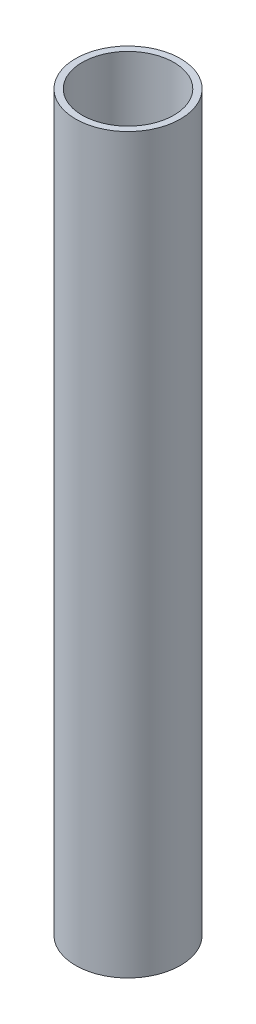
ISO-10303-21;
HEADER;
FILE_DESCRIPTION(('STEP AP214'),'2;1');
FILE_NAME('part.step','',(''),(''),'','','');
FILE_SCHEMA(('AUTOMOTIVE_DESIGN { 1 0 10303 214 1 1 1 1 }'));
ENDSEC;
DATA;
#1=APPLICATION_CONTEXT('core data for automotive mechanical design processes');
#2=APPLICATION_PROTOCOL_DEFINITION('international standard','automotive_design',2000,#1);
#3=PRODUCT_CONTEXT('',#1,'mechanical');
#4=PRODUCT('Part','Part','',(#3));
#5=PRODUCT_RELATED_PRODUCT_CATEGORY('part','',(#4));
#6=PRODUCT_DEFINITION_FORMATION('','',#4);
#7=PRODUCT_DEFINITION_CONTEXT('part definition',#1,'design');
#8=PRODUCT_DEFINITION('design','',#6,#7);
#9=PRODUCT_DEFINITION_SHAPE('','',#8);
#10=(LENGTH_UNIT() NAMED_UNIT(*) SI_UNIT(.MILLI.,.METRE.));
#11=(NAMED_UNIT(*) PLANE_ANGLE_UNIT() SI_UNIT($,.RADIAN.));
#12=(NAMED_UNIT(*) SI_UNIT($,.STERADIAN.) SOLID_ANGLE_UNIT());
#13=UNCERTAINTY_MEASURE_WITH_UNIT(LENGTH_MEASURE(1.E-05),#10,'distance_accuracy_value','');
#14=(GEOMETRIC_REPRESENTATION_CONTEXT(3) GLOBAL_UNCERTAINTY_ASSIGNED_CONTEXT((#13)) GLOBAL_UNIT_ASSIGNED_CONTEXT((#10,
#11,#12)) REPRESENTATION_CONTEXT('',''));
#15=CARTESIAN_POINT('',(0.,0.,0.));
#16=DIRECTION('',(0.,0.,1.));
#17=DIRECTION('',(1.,0.,0.));
#18=AXIS2_PLACEMENT_3D('',#15,#16,#17);
#19=CARTESIAN_POINT('',(0.,609.6,0.));
#20=DIRECTION('',(0.,1.,0.));
#21=DIRECTION('',(0.,0.,1.));
#22=AXIS2_PLACEMENT_3D('',#19,#20,#21);
#23=PLANE('',#22);
#24=CARTESIAN_POINT('',(0.,609.6,0.));
#25=DIRECTION('',(0.,1.,0.));
#26=DIRECTION('',(1.,0.,0.));
#27=AXIS2_PLACEMENT_3D('',#24,#25,#26);
#28=CIRCLE('',#27,43.5864);
#29=CARTESIAN_POINT('',(43.5864,609.6,0.));
#30=VERTEX_POINT('',#29);
#31=EDGE_CURVE('E11',#30,#30,#28,.T.);
#32=ORIENTED_EDGE('',*,*,#31,.T.);
#33=EDGE_LOOP('',(#32));
#34=FACE_BOUND('',#33,.T.);
#35=CARTESIAN_POINT('',(0.,609.6,0.));
#36=DIRECTION('',(0.,1.,0.));
#37=DIRECTION('',(0.,0.,1.));
#38=AXIS2_PLACEMENT_3D('',#35,#36,#37);
#39=CIRCLE('',#38,38.1);
#40=CARTESIAN_POINT('',(0.,609.6,38.1));
#41=VERTEX_POINT('',#40);
#42=EDGE_CURVE('E54',#41,#41,#39,.T.);
#43=ORIENTED_EDGE('',*,*,#42,.F.);
#44=EDGE_LOOP('',(#43));
#45=FACE_BOUND('',#44,.T.);
#46=ADVANCED_FACE('F43',(#34,#45),#23,.T.);
#47=CARTESIAN_POINT('',(0.,0.,0.));
#48=DIRECTION('',(0.,1.,0.));
#49=DIRECTION('',(0.,0.,1.));
#50=AXIS2_PLACEMENT_3D('',#47,#48,#49);
#51=PLANE('',#50);
#52=CARTESIAN_POINT('',(0.,0.,0.));
#53=DIRECTION('',(0.,1.,0.));
#54=DIRECTION('',(1.,0.,0.));
#55=AXIS2_PLACEMENT_3D('',#52,#53,#54);
#56=CIRCLE('',#55,43.5864);
#57=CARTESIAN_POINT('',(43.5864,0.,0.));
#58=VERTEX_POINT('',#57);
#59=EDGE_CURVE('E47',#58,#58,#56,.T.);
#60=ORIENTED_EDGE('',*,*,#59,.F.);
#61=EDGE_LOOP('',(#60));
#62=FACE_BOUND('',#61,.T.);
#63=CARTESIAN_POINT('',(0.,0.,0.));
#64=DIRECTION('',(0.,1.,0.));
#65=DIRECTION('',(0.,0.,1.));
#66=AXIS2_PLACEMENT_3D('',#63,#64,#65);
#67=CIRCLE('',#66,38.1);
#68=CARTESIAN_POINT('',(0.,0.,38.1));
#69=VERTEX_POINT('',#68);
#70=EDGE_CURVE('E56',#69,#69,#67,.T.);
#71=ORIENTED_EDGE('',*,*,#70,.T.);
#72=EDGE_LOOP('',(#71));
#73=FACE_BOUND('',#72,.T.);
#74=ADVANCED_FACE('F66',(#62,#73),#51,.F.);
#75=CARTESIAN_POINT('',(0.,609.6,0.));
#76=DIRECTION('',(0.,-1.,0.));
#77=DIRECTION('',(0.,0.,-1.));
#78=AXIS2_PLACEMENT_3D('',#75,#76,#77);
#79=CYLINDRICAL_SURFACE('',#78,43.5864);
#80=ORIENTED_EDGE('',*,*,#31,.F.);
#81=EDGE_LOOP('',(#80));
#82=FACE_BOUND('',#81,.T.);
#83=ORIENTED_EDGE('',*,*,#59,.T.);
#84=EDGE_LOOP('',(#83));
#85=FACE_BOUND('',#84,.T.);
#86=ADVANCED_FACE('F45',(#82,#85),#79,.T.);
#87=CARTESIAN_POINT('',(0.,609.6,0.));
#88=DIRECTION('',(0.,-1.,0.));
#89=DIRECTION('',(0.,0.,-1.));
#90=AXIS2_PLACEMENT_3D('',#87,#88,#89);
#91=CYLINDRICAL_SURFACE('',#90,38.1);
#92=ORIENTED_EDGE('',*,*,#42,.T.);
#93=EDGE_LOOP('',(#92));
#94=FACE_BOUND('',#93,.T.);
#95=ORIENTED_EDGE('',*,*,#70,.F.);
#96=EDGE_LOOP('',(#95));
#97=FACE_BOUND('',#96,.T.);
#98=ADVANCED_FACE('F62',(#94,#97),#91,.F.);
#99=CLOSED_SHELL('',(#46,#74,#86,#98));
#100=MANIFOLD_SOLID_BREP('B2',#99);
#101=ADVANCED_BREP_SHAPE_REPRESENTATION('',(#18,#100),#14);
#102=SHAPE_DEFINITION_REPRESENTATION(#9,#101);
ENDSEC;
END-ISO-10303-21;
